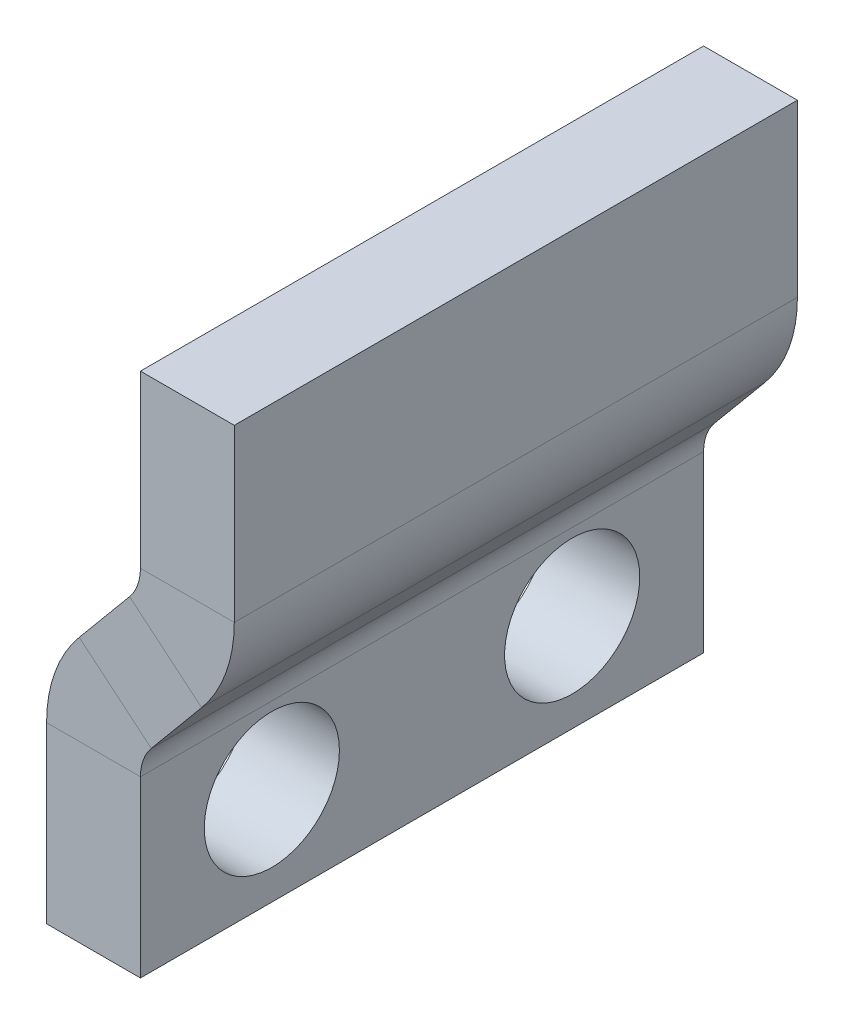
ISO-10303-21;
HEADER;
FILE_DESCRIPTION(('STEP AP214'),'2;1');
FILE_NAME('part.step','',(''),(''),'','','');
FILE_SCHEMA(('AUTOMOTIVE_DESIGN { 1 0 10303 214 1 1 1 1 }'));
ENDSEC;
DATA;
#1=APPLICATION_CONTEXT('core data for automotive mechanical design processes');
#2=APPLICATION_PROTOCOL_DEFINITION('international standard','automotive_design',2000,#1);
#3=PRODUCT_CONTEXT('',#1,'mechanical');
#4=PRODUCT('Part','Part','',(#3));
#5=PRODUCT_RELATED_PRODUCT_CATEGORY('part','',(#4));
#6=PRODUCT_DEFINITION_FORMATION('','',#4);
#7=PRODUCT_DEFINITION_CONTEXT('part definition',#1,'design');
#8=PRODUCT_DEFINITION('design','',#6,#7);
#9=PRODUCT_DEFINITION_SHAPE('','',#8);
#10=(LENGTH_UNIT() NAMED_UNIT(*) SI_UNIT(.MILLI.,.METRE.));
#11=(NAMED_UNIT(*) PLANE_ANGLE_UNIT() SI_UNIT($,.RADIAN.));
#12=(NAMED_UNIT(*) SI_UNIT($,.STERADIAN.) SOLID_ANGLE_UNIT());
#13=UNCERTAINTY_MEASURE_WITH_UNIT(LENGTH_MEASURE(1.E-05),#10,'distance_accuracy_value','');
#14=(GEOMETRIC_REPRESENTATION_CONTEXT(3) GLOBAL_UNCERTAINTY_ASSIGNED_CONTEXT((#13)) GLOBAL_UNIT_ASSIGNED_CONTEXT((#10,
#11,#12)) REPRESENTATION_CONTEXT('',''));
#15=CARTESIAN_POINT('',(0.,0.,0.));
#16=DIRECTION('',(0.,0.,1.));
#17=DIRECTION('',(1.,0.,0.));
#18=AXIS2_PLACEMENT_3D('',#15,#16,#17);
#19=CARTESIAN_POINT('',(0.551923077958748,4.4723076935505,4.7625));
#20=DIRECTION('',(0.,0.,1.));
#21=DIRECTION('',(1.,0.,0.));
#22=AXIS2_PLACEMENT_3D('',#19,#20,#21);
#23=PLANE('',#22);
#24=DIRECTION('',(0.768221279597376,-0.64018439966448,0.));
#25=VECTOR('',#24,1.);
#26=CARTESIAN_POINT('',(0.551923077958748,4.4723076935505,4.7625));
#27=LINE('',#26,#25);
#28=CARTESIAN_POINT('',(0.551923077958748,4.4723076935505,4.7625));
#29=VERTEX_POINT('',#28);
#30=CARTESIAN_POINT('',(1.77147435931958,3.45601495908314,4.7625));
#31=VERTEX_POINT('',#30);
#32=EDGE_CURVE('E11',#29,#31,#27,.T.);
#33=ORIENTED_EDGE('',*,*,#32,.F.);
#34=CARTESIAN_POINT('',(2.38125,2.94786859184945,4.7625));
#35=DIRECTION('',(0.,0.,1.));
#36=DIRECTION('',(1.,0.,0.));
#37=AXIS2_PLACEMENT_3D('',#34,#35,#36);
#38=CIRCLE('',#37,2.38125);
#39=CARTESIAN_POINT('',(0.,2.94786859184945,4.7625));
#40=VERTEX_POINT('',#39);
#41=EDGE_CURVE('E244',#40,#29,#38,.F.);
#42=ORIENTED_EDGE('',*,*,#41,.F.);
#43=DIRECTION('',(-1.,0.,0.));
#44=VECTOR('',#43,1.);
#45=CARTESIAN_POINT('',(1.5875,2.94786859184945,4.7625));
#46=LINE('',#45,#44);
#47=CARTESIAN_POINT('',(1.5875,2.94786859184945,4.7625));
#48=VERTEX_POINT('',#47);
#49=EDGE_CURVE('E41',#48,#40,#46,.T.);
#50=ORIENTED_EDGE('',*,*,#49,.F.);
#51=CARTESIAN_POINT('',(2.38125,2.94786859184945,4.7625));
#52=DIRECTION('',(0.,0.,1.));
#53=DIRECTION('',(1.,0.,0.));
#54=AXIS2_PLACEMENT_3D('',#51,#52,#53);
#55=CIRCLE('',#54,0.79375);
#56=EDGE_CURVE('E142',#48,#31,#55,.F.);
#57=ORIENTED_EDGE('',*,*,#56,.T.);
#58=EDGE_LOOP('',(#33,#42,#50,#57));
#59=FACE_BOUND('',#58,.T.);
#60=ADVANCED_FACE('F33',(#59),#23,.T.);
#61=CARTESIAN_POINT('',(1.5875,2.94786859184945,4.7625));
#62=DIRECTION('',(0.,0.,1.));
#63=DIRECTION('',(1.,0.,0.));
#64=AXIS2_PLACEMENT_3D('',#61,#62,#63);
#65=PLANE('',#64);
#66=DIRECTION('',(0.64018439966448,0.768221279597376,0.));
#67=VECTOR('',#66,1.);
#68=CARTESIAN_POINT('',(0.,3.81,4.7625));
#69=LINE('',#68,#67);
#70=CARTESIAN_POINT('',(1.40352564068042,5.4942307688165,4.7625));
#71=VERTEX_POINT('',#70);
#72=EDGE_CURVE('E136',#29,#71,#69,.T.);
#73=ORIENTED_EDGE('',*,*,#72,.F.);
#74=ORIENTED_EDGE('',*,*,#32,.T.);
#75=DIRECTION('',(0.64018439966448,0.768221279597376,0.));
#76=VECTOR('',#75,1.);
#77=CARTESIAN_POINT('',(1.21955128136083,2.79370726553264,4.7625));
#78=LINE('',#77,#76);
#79=CARTESIAN_POINT('',(2.62307692204125,4.47793803434914,4.7625));
#80=VERTEX_POINT('',#79);
#81=EDGE_CURVE('E133',#31,#80,#78,.T.);
#82=ORIENTED_EDGE('',*,*,#81,.T.);
#83=DIRECTION('',(-0.768221279597375,0.640184399664481,0.));
#84=VECTOR('',#83,1.);
#85=CARTESIAN_POINT('',(2.62307692204125,4.47793803434914,4.7625));
#86=LINE('',#85,#84);
#87=EDGE_CURVE('E225',#80,#71,#86,.T.);
#88=ORIENTED_EDGE('',*,*,#87,.T.);
#89=EDGE_LOOP('',(#73,#74,#82,#88));
#90=FACE_BOUND('',#89,.T.);
#91=ADVANCED_FACE('F131',(#90),#65,.T.);
#92=CARTESIAN_POINT('',(0.,2.94786859184945,-4.7625));
#93=DIRECTION('',(0.,0.,-1.));
#94=DIRECTION('',(-1.,0.,0.));
#95=AXIS2_PLACEMENT_3D('',#92,#93,#94);
#96=PLANE('',#95);
#97=DIRECTION('',(1.,0.,0.));
#98=VECTOR('',#97,1.);
#99=CARTESIAN_POINT('',(0.,2.94786859184945,-4.7625));
#100=LINE('',#99,#98);
#101=CARTESIAN_POINT('',(0.,2.94786859184945,-4.7625));
#102=VERTEX_POINT('',#101);
#103=CARTESIAN_POINT('',(1.5875,2.94786859184945,-4.7625));
#104=VERTEX_POINT('',#103);
#105=EDGE_CURVE('E230',#102,#104,#100,.T.);
#106=ORIENTED_EDGE('',*,*,#105,.F.);
#107=CARTESIAN_POINT('',(2.38125,2.94786859184945,-4.7625));
#108=DIRECTION('',(0.,0.,1.));
#109=DIRECTION('',(1.,0.,0.));
#110=AXIS2_PLACEMENT_3D('',#107,#108,#109);
#111=CIRCLE('',#110,2.38125);
#112=CARTESIAN_POINT('',(0.551923077958748,4.4723076935505,-4.7625));
#113=VERTEX_POINT('',#112);
#114=EDGE_CURVE('E182',#102,#113,#111,.F.);
#115=ORIENTED_EDGE('',*,*,#114,.T.);
#116=DIRECTION('',(-0.768221279597376,0.64018439966448,0.));
#117=VECTOR('',#116,1.);
#118=CARTESIAN_POINT('',(1.77147435931958,3.45601495908314,-4.7625));
#119=LINE('',#118,#117);
#120=CARTESIAN_POINT('',(1.77147435931958,3.45601495908314,-4.7625));
#121=VERTEX_POINT('',#120);
#122=EDGE_CURVE('E228',#121,#113,#119,.T.);
#123=ORIENTED_EDGE('',*,*,#122,.F.);
#124=CARTESIAN_POINT('',(2.38125,2.94786859184945,-4.7625));
#125=DIRECTION('',(0.,0.,1.));
#126=DIRECTION('',(1.,0.,0.));
#127=AXIS2_PLACEMENT_3D('',#124,#125,#126);
#128=CIRCLE('',#127,0.79375);
#129=EDGE_CURVE('E154',#104,#121,#128,.F.);
#130=ORIENTED_EDGE('',*,*,#129,.F.);
#131=EDGE_LOOP('',(#106,#115,#123,#130));
#132=FACE_BOUND('',#131,.T.);
#133=ADVANCED_FACE('F296',(#132),#96,.T.);
#134=CARTESIAN_POINT('',(1.77147435931958,3.45601495908314,-4.7625));
#135=DIRECTION('',(0.,0.,-1.));
#136=DIRECTION('',(-1.,0.,0.));
#137=AXIS2_PLACEMENT_3D('',#134,#135,#136);
#138=PLANE('',#137);
#139=DIRECTION('',(0.,1.,0.));
#140=VECTOR('',#139,1.);
#141=CARTESIAN_POINT('',(0.,0.,-4.7625));
#142=LINE('',#141,#140);
#143=CARTESIAN_POINT('',(0.,0.,-4.7625));
#144=VERTEX_POINT('',#143);
#145=EDGE_CURVE('E185',#144,#102,#142,.T.);
#146=ORIENTED_EDGE('',*,*,#145,.T.);
#147=ORIENTED_EDGE('',*,*,#105,.T.);
#148=DIRECTION('',(0.,1.,0.));
#149=VECTOR('',#148,1.);
#150=CARTESIAN_POINT('',(1.5875,0.,-4.7625));
#151=LINE('',#150,#149);
#152=CARTESIAN_POINT('',(1.5875,0.,-4.7625));
#153=VERTEX_POINT('',#152);
#154=EDGE_CURVE('E191',#153,#104,#151,.T.);
#155=ORIENTED_EDGE('',*,*,#154,.F.);
#156=DIRECTION('',(-1.,0.,0.));
#157=VECTOR('',#156,1.);
#158=CARTESIAN_POINT('',(1.5875,0.,-4.7625));
#159=LINE('',#158,#157);
#160=EDGE_CURVE('E188',#153,#144,#159,.T.);
#161=ORIENTED_EDGE('',*,*,#160,.T.);
#162=EDGE_LOOP('',(#146,#147,#155,#161));
#163=FACE_BOUND('',#162,.T.);
#164=ADVANCED_FACE('F338',(#163),#138,.T.);
#165=CARTESIAN_POINT('',(1.5875,6.00237713605018,4.7625));
#166=DIRECTION('',(0.,0.,1.));
#167=DIRECTION('',(1.,0.,0.));
#168=AXIS2_PLACEMENT_3D('',#165,#166,#167);
#169=PLANE('',#168);
#170=DIRECTION('',(1.,0.,0.));
#171=VECTOR('',#170,1.);
#172=CARTESIAN_POINT('',(1.5875,6.00237713605018,4.7625));
#173=LINE('',#172,#171);
#174=CARTESIAN_POINT('',(1.5875,6.00237713605018,4.7625));
#175=VERTEX_POINT('',#174);
#176=CARTESIAN_POINT('',(3.175,6.00237713605018,4.7625));
#177=VERTEX_POINT('',#176);
#178=EDGE_CURVE('E49',#175,#177,#173,.T.);
#179=ORIENTED_EDGE('',*,*,#178,.F.);
#180=CARTESIAN_POINT('',(0.79375,6.00237713605018,4.7625));
#181=DIRECTION('',(0.,0.,-1.));
#182=DIRECTION('',(-1.,0.,0.));
#183=AXIS2_PLACEMENT_3D('',#180,#181,#182);
#184=CIRCLE('',#183,0.79375);
#185=EDGE_CURVE('E254',#71,#175,#184,.F.);
#186=ORIENTED_EDGE('',*,*,#185,.F.);
#187=ORIENTED_EDGE('',*,*,#87,.F.);
#188=CARTESIAN_POINT('',(0.79375,6.00237713605018,4.7625));
#189=DIRECTION('',(0.,0.,1.));
#190=DIRECTION('',(1.,0.,0.));
#191=AXIS2_PLACEMENT_3D('',#188,#189,#190);
#192=CIRCLE('',#191,2.38125);
#193=EDGE_CURVE('E162',#80,#177,#192,.T.);
#194=ORIENTED_EDGE('',*,*,#193,.T.);
#195=EDGE_LOOP('',(#179,#186,#187,#194));
#196=FACE_BOUND('',#195,.T.);
#197=ADVANCED_FACE('F343',(#196),#169,.T.);
#198=CARTESIAN_POINT('',(2.62307692204125,4.47793803434914,4.7625));
#199=DIRECTION('',(0.,0.,1.));
#200=DIRECTION('',(1.,0.,0.));
#201=AXIS2_PLACEMENT_3D('',#198,#199,#200);
#202=PLANE('',#201);
#203=DIRECTION('',(0.,1.,0.));
#204=VECTOR('',#203,1.);
#205=CARTESIAN_POINT('',(1.5875,5.715,4.7625));
#206=LINE('',#205,#204);
#207=CARTESIAN_POINT('',(1.5875,8.89,4.7625));
#208=VERTEX_POINT('',#207);
#209=EDGE_CURVE('E257',#175,#208,#206,.T.);
#210=ORIENTED_EDGE('',*,*,#209,.F.);
#211=ORIENTED_EDGE('',*,*,#178,.T.);
#212=DIRECTION('',(0.,1.,0.));
#213=VECTOR('',#212,1.);
#214=CARTESIAN_POINT('',(3.175,5.715,4.7625));
#215=LINE('',#214,#213);
#216=CARTESIAN_POINT('',(3.175,8.89,4.7625));
#217=VERTEX_POINT('',#216);
#218=EDGE_CURVE('E103',#177,#217,#215,.T.);
#219=ORIENTED_EDGE('',*,*,#218,.T.);
#220=DIRECTION('',(1.,0.,0.));
#221=VECTOR('',#220,1.);
#222=CARTESIAN_POINT('',(1.5875,8.89,4.7625));
#223=LINE('',#222,#221);
#224=EDGE_CURVE('E260',#208,#217,#223,.T.);
#225=ORIENTED_EDGE('',*,*,#224,.F.);
#226=EDGE_LOOP('',(#210,#211,#219,#225));
#227=FACE_BOUND('',#226,.T.);
#228=ADVANCED_FACE('F320',(#227),#202,.T.);
#229=CARTESIAN_POINT('',(1.40352564068042,5.4942307688165,-4.7625));
#230=DIRECTION('',(0.,0.,-1.));
#231=DIRECTION('',(-1.,0.,0.));
#232=AXIS2_PLACEMENT_3D('',#229,#230,#231);
#233=PLANE('',#232);
#234=DIRECTION('',(0.768221279597375,-0.640184399664481,0.));
#235=VECTOR('',#234,1.);
#236=CARTESIAN_POINT('',(1.40352564068042,5.4942307688165,-4.7625));
#237=LINE('',#236,#235);
#238=CARTESIAN_POINT('',(1.40352564068042,5.4942307688165,-4.7625));
#239=VERTEX_POINT('',#238);
#240=CARTESIAN_POINT('',(2.62307692204125,4.47793803434914,-4.7625));
#241=VERTEX_POINT('',#240);
#242=EDGE_CURVE('E90',#239,#241,#237,.T.);
#243=ORIENTED_EDGE('',*,*,#242,.F.);
#244=CARTESIAN_POINT('',(0.79375,6.00237713605018,-4.7625));
#245=DIRECTION('',(0.,0.,-1.));
#246=DIRECTION('',(-1.,0.,0.));
#247=AXIS2_PLACEMENT_3D('',#244,#245,#246);
#248=CIRCLE('',#247,0.79375);
#249=CARTESIAN_POINT('',(1.5875,6.00237713605018,-4.7625));
#250=VERTEX_POINT('',#249);
#251=EDGE_CURVE('E178',#239,#250,#248,.F.);
#252=ORIENTED_EDGE('',*,*,#251,.T.);
#253=DIRECTION('',(-1.,0.,0.));
#254=VECTOR('',#253,1.);
#255=CARTESIAN_POINT('',(3.175,6.00237713605018,-4.7625));
#256=LINE('',#255,#254);
#257=CARTESIAN_POINT('',(3.175,6.00237713605018,-4.7625));
#258=VERTEX_POINT('',#257);
#259=EDGE_CURVE('E97',#258,#250,#256,.T.);
#260=ORIENTED_EDGE('',*,*,#259,.F.);
#261=CARTESIAN_POINT('',(0.79375,6.00237713605018,-4.7625));
#262=DIRECTION('',(0.,0.,1.));
#263=DIRECTION('',(1.,0.,0.));
#264=AXIS2_PLACEMENT_3D('',#261,#262,#263);
#265=CIRCLE('',#264,2.38125);
#266=EDGE_CURVE('E197',#241,#258,#265,.T.);
#267=ORIENTED_EDGE('',*,*,#266,.F.);
#268=EDGE_LOOP('',(#243,#252,#260,#267));
#269=FACE_BOUND('',#268,.T.);
#270=ADVANCED_FACE('F308',(#269),#233,.T.);
#271=CARTESIAN_POINT('',(3.175,6.00237713605018,-4.7625));
#272=DIRECTION('',(0.,0.,-1.));
#273=DIRECTION('',(-1.,0.,0.));
#274=AXIS2_PLACEMENT_3D('',#271,#272,#273);
#275=PLANE('',#274);
#276=DIRECTION('',(0.64018439966448,0.768221279597376,0.));
#277=VECTOR('',#276,1.);
#278=CARTESIAN_POINT('',(0.,3.81,-4.7625));
#279=LINE('',#278,#277);
#280=EDGE_CURVE('E180',#113,#239,#279,.T.);
#281=ORIENTED_EDGE('',*,*,#280,.T.);
#282=ORIENTED_EDGE('',*,*,#242,.T.);
#283=DIRECTION('',(0.64018439966448,0.768221279597376,0.));
#284=VECTOR('',#283,1.);
#285=CARTESIAN_POINT('',(1.21955128136083,2.79370726553264,-4.7625));
#286=LINE('',#285,#284);
#287=EDGE_CURVE('E195',#121,#241,#286,.T.);
#288=ORIENTED_EDGE('',*,*,#287,.F.);
#289=ORIENTED_EDGE('',*,*,#122,.T.);
#290=EDGE_LOOP('',(#281,#282,#288,#289));
#291=FACE_BOUND('',#290,.T.);
#292=ADVANCED_FACE('F297',(#291),#275,.T.);
#293=CARTESIAN_POINT('',(3.175,5.715,4.7625));
#294=DIRECTION('',(-1.,0.,0.));
#295=DIRECTION('',(0.,0.,1.));
#296=AXIS2_PLACEMENT_3D('',#293,#294,#295);
#297=PLANE('',#296);
#298=DIRECTION('',(0.,1.,0.));
#299=VECTOR('',#298,1.);
#300=CARTESIAN_POINT('',(3.175,5.715,-4.7625));
#301=LINE('',#300,#299);
#302=CARTESIAN_POINT('',(3.175,8.89,-4.7625));
#303=VERTEX_POINT('',#302);
#304=EDGE_CURVE('E168',#258,#303,#301,.T.);
#305=ORIENTED_EDGE('',*,*,#304,.T.);
#306=DIRECTION('',(0.,0.,-1.));
#307=VECTOR('',#306,1.);
#308=CARTESIAN_POINT('',(3.175,8.89,4.7625));
#309=LINE('',#308,#307);
#310=EDGE_CURVE('E221',#217,#303,#309,.T.);
#311=ORIENTED_EDGE('',*,*,#310,.F.);
#312=ORIENTED_EDGE('',*,*,#218,.F.);
#313=DIRECTION('',(0.,0.,-1.));
#314=VECTOR('',#313,1.);
#315=CARTESIAN_POINT('',(3.175,6.00237713605018,4.7625));
#316=LINE('',#315,#314);
#317=EDGE_CURVE('E164',#177,#258,#316,.T.);
#318=ORIENTED_EDGE('',*,*,#317,.T.);
#319=EDGE_LOOP('',(#305,#311,#312,#318));
#320=FACE_BOUND('',#319,.T.);
#321=ADVANCED_FACE('F314',(#320),#297,.F.);
#322=CARTESIAN_POINT('',(1.5875,8.89,4.7625));
#323=DIRECTION('',(0.,1.,0.));
#324=DIRECTION('',(0.,0.,1.));
#325=AXIS2_PLACEMENT_3D('',#322,#323,#324);
#326=PLANE('',#325);
#327=DIRECTION('',(1.,0.,0.));
#328=VECTOR('',#327,1.);
#329=CARTESIAN_POINT('',(1.5875,8.89,-4.7625));
#330=LINE('',#329,#328);
#331=CARTESIAN_POINT('',(1.5875,8.89,-4.7625));
#332=VERTEX_POINT('',#331);
#333=EDGE_CURVE('E171',#332,#303,#330,.T.);
#334=ORIENTED_EDGE('',*,*,#333,.F.);
#335=DIRECTION('',(0.,0.,-1.));
#336=VECTOR('',#335,1.);
#337=CARTESIAN_POINT('',(1.5875,8.89,4.7625));
#338=LINE('',#337,#336);
#339=EDGE_CURVE('E219',#208,#332,#338,.T.);
#340=ORIENTED_EDGE('',*,*,#339,.F.);
#341=ORIENTED_EDGE('',*,*,#224,.T.);
#342=ORIENTED_EDGE('',*,*,#310,.T.);
#343=EDGE_LOOP('',(#334,#340,#341,#342));
#344=FACE_BOUND('',#343,.T.);
#345=ADVANCED_FACE('F319',(#344),#326,.T.);
#346=CARTESIAN_POINT('',(1.5875,5.715,4.7625));
#347=DIRECTION('',(-1.,0.,0.));
#348=DIRECTION('',(0.,0.,1.));
#349=AXIS2_PLACEMENT_3D('',#346,#347,#348);
#350=PLANE('',#349);
#351=DIRECTION('',(0.,1.,0.));
#352=VECTOR('',#351,1.);
#353=CARTESIAN_POINT('',(1.5875,5.715,-4.7625));
#354=LINE('',#353,#352);
#355=EDGE_CURVE('E175',#250,#332,#354,.T.);
#356=ORIENTED_EDGE('',*,*,#355,.F.);
#357=DIRECTION('',(0.,0.,-1.));
#358=VECTOR('',#357,1.);
#359=CARTESIAN_POINT('',(1.5875,6.00237713605018,4.7625));
#360=LINE('',#359,#358);
#361=EDGE_CURVE('E216',#175,#250,#360,.T.);
#362=ORIENTED_EDGE('',*,*,#361,.F.);
#363=ORIENTED_EDGE('',*,*,#209,.T.);
#364=ORIENTED_EDGE('',*,*,#339,.T.);
#365=EDGE_LOOP('',(#356,#362,#363,#364));
#366=FACE_BOUND('',#365,.T.);
#367=ADVANCED_FACE('F322',(#366),#350,.T.);
#368=CARTESIAN_POINT('',(0.79375,6.00237713605018,4.7625));
#369=DIRECTION('',(0.,0.,-1.));
#370=DIRECTION('',(-1.,0.,0.));
#371=AXIS2_PLACEMENT_3D('',#368,#369,#370);
#372=CYLINDRICAL_SURFACE('',#371,0.79375);
#373=ORIENTED_EDGE('',*,*,#251,.F.);
#374=DIRECTION('',(0.,0.,-1.));
#375=VECTOR('',#374,1.);
#376=CARTESIAN_POINT('',(1.40352564068042,5.4942307688165,4.7625));
#377=LINE('',#376,#375);
#378=EDGE_CURVE('E213',#71,#239,#377,.T.);
#379=ORIENTED_EDGE('',*,*,#378,.F.);
#380=ORIENTED_EDGE('',*,*,#185,.T.);
#381=ORIENTED_EDGE('',*,*,#361,.T.);
#382=EDGE_LOOP('',(#373,#379,#380,#381));
#383=FACE_BOUND('',#382,.T.);
#384=ADVANCED_FACE('F305',(#383),#372,.F.);
#385=CARTESIAN_POINT('',(0.,3.81,4.7625));
#386=DIRECTION('',(-0.768221279597376,0.64018439966448,0.));
#387=DIRECTION('',(-0.64018439966448,-0.768221279597376,0.));
#388=AXIS2_PLACEMENT_3D('',#385,#386,#387);
#389=PLANE('',#388);
#390=ORIENTED_EDGE('',*,*,#280,.F.);
#391=DIRECTION('',(0.,0.,-1.));
#392=VECTOR('',#391,1.);
#393=CARTESIAN_POINT('',(0.551923077958748,4.4723076935505,4.7625));
#394=LINE('',#393,#392);
#395=EDGE_CURVE('E210',#29,#113,#394,.T.);
#396=ORIENTED_EDGE('',*,*,#395,.F.);
#397=ORIENTED_EDGE('',*,*,#72,.T.);
#398=ORIENTED_EDGE('',*,*,#378,.T.);
#399=EDGE_LOOP('',(#390,#396,#397,#398));
#400=FACE_BOUND('',#399,.T.);
#401=ADVANCED_FACE('F300',(#400),#389,.T.);
#402=CARTESIAN_POINT('',(2.38125,2.94786859184945,4.7625));
#403=DIRECTION('',(0.,0.,-1.));
#404=DIRECTION('',(-1.,0.,0.));
#405=AXIS2_PLACEMENT_3D('',#402,#403,#404);
#406=CYLINDRICAL_SURFACE('',#405,2.38125);
#407=ORIENTED_EDGE('',*,*,#114,.F.);
#408=DIRECTION('',(0.,0.,-1.));
#409=VECTOR('',#408,1.);
#410=CARTESIAN_POINT('',(0.,2.94786859184945,4.7625));
#411=LINE('',#410,#409);
#412=EDGE_CURVE('E207',#40,#102,#411,.T.);
#413=ORIENTED_EDGE('',*,*,#412,.F.);
#414=ORIENTED_EDGE('',*,*,#41,.T.);
#415=ORIENTED_EDGE('',*,*,#395,.T.);
#416=EDGE_LOOP('',(#407,#413,#414,#415));
#417=FACE_BOUND('',#416,.T.);
#418=ADVANCED_FACE('F243',(#417),#406,.T.);
#419=CARTESIAN_POINT('',(0.,0.,4.7625));
#420=DIRECTION('',(-1.,0.,0.));
#421=DIRECTION('',(0.,0.,1.));
#422=AXIS2_PLACEMENT_3D('',#419,#420,#421);
#423=PLANE('',#422);
#424=CARTESIAN_POINT('',(0.,1.651,2.54));
#425=DIRECTION('',(1.,0.,0.));
#426=DIRECTION('',(0.,0.,-1.));
#427=AXIS2_PLACEMENT_3D('',#424,#425,#426);
#428=CIRCLE('',#427,1.143);
#429=CARTESIAN_POINT('',(0.,1.651,1.397));
#430=VERTEX_POINT('',#429);
#431=EDGE_CURVE('E267',#430,#430,#428,.T.);
#432=ORIENTED_EDGE('',*,*,#431,.T.);
#433=EDGE_LOOP('',(#432));
#434=FACE_BOUND('',#433,.T.);
#435=CARTESIAN_POINT('',(0.,1.651,-2.54));
#436=DIRECTION('',(1.,0.,0.));
#437=DIRECTION('',(0.,0.,-1.));
#438=AXIS2_PLACEMENT_3D('',#435,#436,#437);
#439=CIRCLE('',#438,1.143);
#440=CARTESIAN_POINT('',(0.,1.651,-3.683));
#441=VERTEX_POINT('',#440);
#442=EDGE_CURVE('E172',#441,#441,#439,.T.);
#443=ORIENTED_EDGE('',*,*,#442,.T.);
#444=EDGE_LOOP('',(#443));
#445=FACE_BOUND('',#444,.T.);
#446=ORIENTED_EDGE('',*,*,#145,.F.);
#447=DIRECTION('',(0.,0.,-1.));
#448=VECTOR('',#447,1.);
#449=CARTESIAN_POINT('',(0.,0.,4.7625));
#450=LINE('',#449,#448);
#451=CARTESIAN_POINT('',(0.,0.,4.7625));
#452=VERTEX_POINT('',#451);
#453=EDGE_CURVE('E205',#452,#144,#450,.T.);
#454=ORIENTED_EDGE('',*,*,#453,.F.);
#455=DIRECTION('',(0.,1.,0.));
#456=VECTOR('',#455,1.);
#457=CARTESIAN_POINT('',(0.,0.,4.7625));
#458=LINE('',#457,#456);
#459=EDGE_CURVE('E237',#452,#40,#458,.T.);
#460=ORIENTED_EDGE('',*,*,#459,.T.);
#461=ORIENTED_EDGE('',*,*,#412,.T.);
#462=EDGE_LOOP('',(#446,#454,#460,#461));
#463=FACE_BOUND('',#462,.T.);
#464=ADVANCED_FACE('F248',(#434,#445,#463),#423,.T.);
#465=CARTESIAN_POINT('',(1.5875,0.,4.7625));
#466=DIRECTION('',(0.,-1.,0.));
#467=DIRECTION('',(0.,0.,-1.));
#468=AXIS2_PLACEMENT_3D('',#465,#466,#467);
#469=PLANE('',#468);
#470=ORIENTED_EDGE('',*,*,#160,.F.);
#471=DIRECTION('',(0.,0.,-1.));
#472=VECTOR('',#471,1.);
#473=CARTESIAN_POINT('',(1.5875,0.,4.7625));
#474=LINE('',#473,#472);
#475=CARTESIAN_POINT('',(1.5875,0.,4.7625));
#476=VERTEX_POINT('',#475);
#477=EDGE_CURVE('E203',#476,#153,#474,.T.);
#478=ORIENTED_EDGE('',*,*,#477,.F.);
#479=DIRECTION('',(-1.,0.,0.));
#480=VECTOR('',#479,1.);
#481=CARTESIAN_POINT('',(1.5875,0.,4.7625));
#482=LINE('',#481,#480);
#483=EDGE_CURVE('E249',#476,#452,#482,.T.);
#484=ORIENTED_EDGE('',*,*,#483,.T.);
#485=ORIENTED_EDGE('',*,*,#453,.T.);
#486=EDGE_LOOP('',(#470,#478,#484,#485));
#487=FACE_BOUND('',#486,.T.);
#488=ADVANCED_FACE('F288',(#487),#469,.T.);
#489=CARTESIAN_POINT('',(1.5875,0.,4.7625));
#490=DIRECTION('',(-1.,0.,0.));
#491=DIRECTION('',(0.,0.,1.));
#492=AXIS2_PLACEMENT_3D('',#489,#490,#491);
#493=PLANE('',#492);
#494=CARTESIAN_POINT('',(1.5875,1.651,2.54));
#495=DIRECTION('',(1.,0.,0.));
#496=DIRECTION('',(0.,0.,-1.));
#497=AXIS2_PLACEMENT_3D('',#494,#495,#496);
#498=CIRCLE('',#497,1.143);
#499=CARTESIAN_POINT('',(1.5875,1.651,1.397));
#500=VERTEX_POINT('',#499);
#501=EDGE_CURVE('E270',#500,#500,#498,.T.);
#502=ORIENTED_EDGE('',*,*,#501,.F.);
#503=EDGE_LOOP('',(#502));
#504=FACE_BOUND('',#503,.T.);
#505=CARTESIAN_POINT('',(1.5875,1.651,-2.54));
#506=DIRECTION('',(1.,0.,0.));
#507=DIRECTION('',(0.,0.,-1.));
#508=AXIS2_PLACEMENT_3D('',#505,#506,#507);
#509=CIRCLE('',#508,1.143);
#510=CARTESIAN_POINT('',(1.5875,1.651,-3.683));
#511=VERTEX_POINT('',#510);
#512=EDGE_CURVE('E264',#511,#511,#509,.T.);
#513=ORIENTED_EDGE('',*,*,#512,.F.);
#514=EDGE_LOOP('',(#513));
#515=FACE_BOUND('',#514,.T.);
#516=ORIENTED_EDGE('',*,*,#154,.T.);
#517=DIRECTION('',(0.,0.,-1.));
#518=VECTOR('',#517,1.);
#519=CARTESIAN_POINT('',(1.5875,2.94786859184945,4.7625));
#520=LINE('',#519,#518);
#521=EDGE_CURVE('E156',#48,#104,#520,.T.);
#522=ORIENTED_EDGE('',*,*,#521,.F.);
#523=DIRECTION('',(0.,1.,0.));
#524=VECTOR('',#523,1.);
#525=CARTESIAN_POINT('',(1.5875,0.,4.7625));
#526=LINE('',#525,#524);
#527=EDGE_CURVE('E147',#476,#48,#526,.T.);
#528=ORIENTED_EDGE('',*,*,#527,.F.);
#529=ORIENTED_EDGE('',*,*,#477,.T.);
#530=EDGE_LOOP('',(#516,#522,#528,#529));
#531=FACE_BOUND('',#530,.T.);
#532=ADVANCED_FACE('F285',(#504,#515,#531),#493,.F.);
#533=CARTESIAN_POINT('',(2.38125,2.94786859184945,4.7625));
#534=DIRECTION('',(0.,0.,-1.));
#535=DIRECTION('',(-1.,0.,0.));
#536=AXIS2_PLACEMENT_3D('',#533,#534,#535);
#537=CYLINDRICAL_SURFACE('',#536,0.79375);
#538=ORIENTED_EDGE('',*,*,#129,.T.);
#539=DIRECTION('',(0.,0.,-1.));
#540=VECTOR('',#539,1.);
#541=CARTESIAN_POINT('',(1.77147435931958,3.45601495908314,4.7625));
#542=LINE('',#541,#540);
#543=EDGE_CURVE('E151',#31,#121,#542,.T.);
#544=ORIENTED_EDGE('',*,*,#543,.F.);
#545=ORIENTED_EDGE('',*,*,#56,.F.);
#546=ORIENTED_EDGE('',*,*,#521,.T.);
#547=EDGE_LOOP('',(#538,#544,#545,#546));
#548=FACE_BOUND('',#547,.T.);
#549=ADVANCED_FACE('F152',(#548),#537,.F.);
#550=CARTESIAN_POINT('',(1.21955128136083,2.79370726553264,4.7625));
#551=DIRECTION('',(-0.768221279597376,0.64018439966448,0.));
#552=DIRECTION('',(-0.64018439966448,-0.768221279597376,0.));
#553=AXIS2_PLACEMENT_3D('',#550,#551,#552);
#554=PLANE('',#553);
#555=ORIENTED_EDGE('',*,*,#287,.T.);
#556=DIRECTION('',(0.,0.,-1.));
#557=VECTOR('',#556,1.);
#558=CARTESIAN_POINT('',(2.62307692204125,4.47793803434914,4.7625));
#559=LINE('',#558,#557);
#560=EDGE_CURVE('E157',#80,#241,#559,.T.);
#561=ORIENTED_EDGE('',*,*,#560,.F.);
#562=ORIENTED_EDGE('',*,*,#81,.F.);
#563=ORIENTED_EDGE('',*,*,#543,.T.);
#564=EDGE_LOOP('',(#555,#561,#562,#563));
#565=FACE_BOUND('',#564,.T.);
#566=ADVANCED_FACE('F159',(#565),#554,.F.);
#567=CARTESIAN_POINT('',(0.79375,6.00237713605018,4.7625));
#568=DIRECTION('',(0.,0.,-1.));
#569=DIRECTION('',(-1.,0.,0.));
#570=AXIS2_PLACEMENT_3D('',#567,#568,#569);
#571=CYLINDRICAL_SURFACE('',#570,2.38125);
#572=ORIENTED_EDGE('',*,*,#266,.T.);
#573=ORIENTED_EDGE('',*,*,#317,.F.);
#574=ORIENTED_EDGE('',*,*,#193,.F.);
#575=ORIENTED_EDGE('',*,*,#560,.T.);
#576=EDGE_LOOP('',(#572,#573,#574,#575));
#577=FACE_BOUND('',#576,.T.);
#578=ADVANCED_FACE('F311',(#577),#571,.T.);
#579=CARTESIAN_POINT('',(0.79375,6.00237713605018,4.7625));
#580=DIRECTION('',(0.,0.,-1.));
#581=DIRECTION('',(-1.,0.,0.));
#582=AXIS2_PLACEMENT_3D('',#579,#580,#581);
#583=PLANE('',#582);
#584=ORIENTED_EDGE('',*,*,#527,.T.);
#585=ORIENTED_EDGE('',*,*,#49,.T.);
#586=ORIENTED_EDGE('',*,*,#459,.F.);
#587=ORIENTED_EDGE('',*,*,#483,.F.);
#588=EDGE_LOOP('',(#584,#585,#586,#587));
#589=FACE_BOUND('',#588,.T.);
#590=ADVANCED_FACE('F234',(#589),#583,.F.);
#591=CARTESIAN_POINT('',(0.79375,6.00237713605018,-4.7625));
#592=DIRECTION('',(0.,0.,-1.));
#593=DIRECTION('',(-1.,0.,0.));
#594=AXIS2_PLACEMENT_3D('',#591,#592,#593);
#595=PLANE('',#594);
#596=ORIENTED_EDGE('',*,*,#304,.F.);
#597=ORIENTED_EDGE('',*,*,#259,.T.);
#598=ORIENTED_EDGE('',*,*,#355,.T.);
#599=ORIENTED_EDGE('',*,*,#333,.T.);
#600=EDGE_LOOP('',(#596,#597,#598,#599));
#601=FACE_BOUND('',#600,.T.);
#602=ADVANCED_FACE('F316',(#601),#595,.T.);
#603=CARTESIAN_POINT('',(0.,1.651,-2.54));
#604=DIRECTION('',(1.,0.,0.));
#605=DIRECTION('',(0.,0.,-1.));
#606=AXIS2_PLACEMENT_3D('',#603,#604,#605);
#607=CYLINDRICAL_SURFACE('',#606,1.143);
#608=ORIENTED_EDGE('',*,*,#442,.F.);
#609=EDGE_LOOP('',(#608));
#610=FACE_BOUND('',#609,.T.);
#611=ORIENTED_EDGE('',*,*,#512,.T.);
#612=EDGE_LOOP('',(#611));
#613=FACE_BOUND('',#612,.T.);
#614=ADVANCED_FACE('F281',(#610,#613),#607,.F.);
#615=CARTESIAN_POINT('',(0.,1.651,2.54));
#616=DIRECTION('',(1.,0.,0.));
#617=DIRECTION('',(0.,0.,-1.));
#618=AXIS2_PLACEMENT_3D('',#615,#616,#617);
#619=CYLINDRICAL_SURFACE('',#618,1.143);
#620=ORIENTED_EDGE('',*,*,#431,.F.);
#621=EDGE_LOOP('',(#620));
#622=FACE_BOUND('',#621,.T.);
#623=ORIENTED_EDGE('',*,*,#501,.T.);
#624=EDGE_LOOP('',(#623));
#625=FACE_BOUND('',#624,.T.);
#626=ADVANCED_FACE('F278',(#622,#625),#619,.F.);
#627=CLOSED_SHELL('',(#60,#91,#133,#164,#197,#228,#270,#292,#321,#345,#367,#384,#401,#418,#464,
#488,#532,#549,#566,#578,#590,#602,#614,#626));
#628=MANIFOLD_SOLID_BREP('B2',#627);
#629=ADVANCED_BREP_SHAPE_REPRESENTATION('',(#18,#628),#14);
#630=SHAPE_DEFINITION_REPRESENTATION(#9,#629);
ENDSEC;
END-ISO-10303-21;
